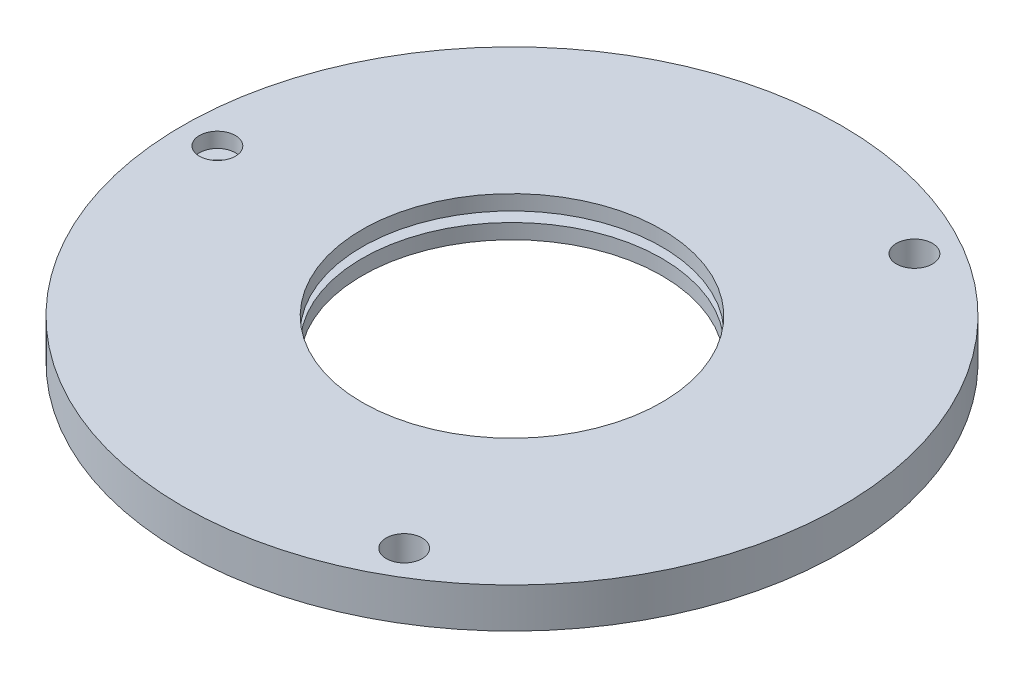
ISO-10303-21;
HEADER;
FILE_DESCRIPTION(('STEP AP214'),'2;1');
FILE_NAME('part.step','',(''),(''),'','','');
FILE_SCHEMA(('AUTOMOTIVE_DESIGN { 1 0 10303 214 1 1 1 1 }'));
ENDSEC;
DATA;
#1=APPLICATION_CONTEXT('core data for automotive mechanical design processes');
#2=APPLICATION_PROTOCOL_DEFINITION('international standard','automotive_design',2000,#1);
#3=PRODUCT_CONTEXT('',#1,'mechanical');
#4=PRODUCT('Part','Part','',(#3));
#5=PRODUCT_RELATED_PRODUCT_CATEGORY('part','',(#4));
#6=PRODUCT_DEFINITION_FORMATION('','',#4);
#7=PRODUCT_DEFINITION_CONTEXT('part definition',#1,'design');
#8=PRODUCT_DEFINITION('design','',#6,#7);
#9=PRODUCT_DEFINITION_SHAPE('','',#8);
#10=(LENGTH_UNIT() NAMED_UNIT(*) SI_UNIT(.MILLI.,.METRE.));
#11=(NAMED_UNIT(*) PLANE_ANGLE_UNIT() SI_UNIT($,.RADIAN.));
#12=(NAMED_UNIT(*) SI_UNIT($,.STERADIAN.) SOLID_ANGLE_UNIT());
#13=UNCERTAINTY_MEASURE_WITH_UNIT(LENGTH_MEASURE(1.E-05),#10,'distance_accuracy_value','');
#14=(GEOMETRIC_REPRESENTATION_CONTEXT(3) GLOBAL_UNCERTAINTY_ASSIGNED_CONTEXT((#13)) GLOBAL_UNIT_ASSIGNED_CONTEXT((#10,
#11,#12)) REPRESENTATION_CONTEXT('',''));
#15=CARTESIAN_POINT('',(0.,0.,0.));
#16=DIRECTION('',(0.,0.,1.));
#17=DIRECTION('',(1.,0.,0.));
#18=AXIS2_PLACEMENT_3D('',#15,#16,#17);
#19=CARTESIAN_POINT('',(-29.5,0.,0.));
#20=DIRECTION('',(0.,-1.,0.));
#21=DIRECTION('',(0.,0.,-1.));
#22=AXIS2_PLACEMENT_3D('',#19,#20,#21);
#23=CYLINDRICAL_SURFACE('',#22,1.8);
#24=CARTESIAN_POINT('',(-29.5,1.5,0.));
#25=DIRECTION('',(0.,-1.,0.));
#26=DIRECTION('',(0.,0.,-1.));
#27=AXIS2_PLACEMENT_3D('',#24,#25,#26);
#28=CIRCLE('',#27,1.8);
#29=CARTESIAN_POINT('',(-29.5,1.5,-1.8));
#30=VERTEX_POINT('',#29);
#31=EDGE_CURVE('E109',#30,#30,#28,.F.);
#32=ORIENTED_EDGE('',*,*,#31,.T.);
#33=EDGE_LOOP('',(#32));
#34=FACE_BOUND('',#33,.T.);
#35=CARTESIAN_POINT('',(-29.5,1.35,0.));
#36=DIRECTION('',(0.,-1.,0.));
#37=DIRECTION('',(0.,0.,-1.));
#38=AXIS2_PLACEMENT_3D('',#35,#36,#37);
#39=CIRCLE('',#38,1.8);
#40=CARTESIAN_POINT('',(-29.5,1.35,-1.8));
#41=VERTEX_POINT('',#40);
#42=EDGE_CURVE('E131',#41,#41,#39,.T.);
#43=ORIENTED_EDGE('',*,*,#42,.T.);
#44=EDGE_LOOP('',(#43));
#45=FACE_BOUND('',#44,.T.);
#46=ADVANCED_FACE('F32',(#34,#45),#23,.F.);
#47=CARTESIAN_POINT('',(0.,4.001,0.));
#48=DIRECTION('',(0.,-1.,0.));
#49=DIRECTION('',(0.,0.,-1.));
#50=AXIS2_PLACEMENT_3D('',#47,#48,#49);
#51=CYLINDRICAL_SURFACE('',#50,15.);
#52=CARTESIAN_POINT('',(0.,1.5,0.));
#53=DIRECTION('',(0.,-1.,0.));
#54=DIRECTION('',(0.,0.,-1.));
#55=AXIS2_PLACEMENT_3D('',#52,#53,#54);
#56=CIRCLE('',#55,15.);
#57=CARTESIAN_POINT('',(0.,1.5,-15.));
#58=VERTEX_POINT('',#57);
#59=EDGE_CURVE('E108',#58,#58,#56,.F.);
#60=ORIENTED_EDGE('',*,*,#59,.T.);
#61=EDGE_LOOP('',(#60));
#62=FACE_BOUND('',#61,.T.);
#63=CARTESIAN_POINT('',(0.,0.,0.));
#64=DIRECTION('',(0.,-1.,0.));
#65=DIRECTION('',(0.,0.,-1.));
#66=AXIS2_PLACEMENT_3D('',#63,#64,#65);
#67=CIRCLE('',#66,15.);
#68=CARTESIAN_POINT('',(0.,0.,-15.));
#69=VERTEX_POINT('',#68);
#70=EDGE_CURVE('E114',#69,#69,#67,.T.);
#71=ORIENTED_EDGE('',*,*,#70,.T.);
#72=EDGE_LOOP('',(#71));
#73=FACE_BOUND('',#72,.T.);
#74=ADVANCED_FACE('F174',(#62,#73),#51,.F.);
#75=CARTESIAN_POINT('',(0.,0.,0.));
#76=DIRECTION('',(0.,1.,0.));
#77=DIRECTION('',(0.,0.,1.));
#78=AXIS2_PLACEMENT_3D('',#75,#76,#77);
#79=PLANE('',#78);
#80=ORIENTED_EDGE('',*,*,#70,.F.);
#81=EDGE_LOOP('',(#80));
#82=FACE_BOUND('',#81,.T.);
#83=CARTESIAN_POINT('',(14.7499999999996,0.,-25.5477494116416));
#84=DIRECTION('',(0.,-1.,0.));
#85=DIRECTION('',(0.,0.,-1.));
#86=AXIS2_PLACEMENT_3D('',#83,#84,#85);
#87=CIRCLE('',#86,3.15);
#88=CARTESIAN_POINT('',(14.7499999999996,0.,-28.6977494116416));
#89=VERTEX_POINT('',#88);
#90=EDGE_CURVE('E137',#89,#89,#87,.T.);
#91=ORIENTED_EDGE('',*,*,#90,.F.);
#92=EDGE_LOOP('',(#91));
#93=FACE_BOUND('',#92,.T.);
#94=CARTESIAN_POINT('',(0.,0.,0.));
#95=DIRECTION('',(0.,1.,0.));
#96=DIRECTION('',(0.,0.,1.));
#97=AXIS2_PLACEMENT_3D('',#94,#95,#96);
#98=CIRCLE('',#97,33.);
#99=CARTESIAN_POINT('',(0.,0.,33.));
#100=VERTEX_POINT('',#99);
#101=EDGE_CURVE('E146',#100,#100,#98,.T.);
#102=ORIENTED_EDGE('',*,*,#101,.F.);
#103=EDGE_LOOP('',(#102));
#104=FACE_BOUND('',#103,.T.);
#105=CARTESIAN_POINT('',(-29.5,0.,0.));
#106=DIRECTION('',(0.,-1.,0.));
#107=DIRECTION('',(0.,0.,-1.));
#108=AXIS2_PLACEMENT_3D('',#105,#106,#107);
#109=CIRCLE('',#108,3.15);
#110=CARTESIAN_POINT('',(-29.5,0.,-3.15));
#111=VERTEX_POINT('',#110);
#112=EDGE_CURVE('E128',#111,#111,#109,.T.);
#113=ORIENTED_EDGE('',*,*,#112,.F.);
#114=EDGE_LOOP('',(#113));
#115=FACE_BOUND('',#114,.T.);
#116=CARTESIAN_POINT('',(14.7500000000004,0.,25.5477494116403));
#117=DIRECTION('',(0.,-1.,0.));
#118=DIRECTION('',(0.,0.,-1.));
#119=AXIS2_PLACEMENT_3D('',#116,#117,#118);
#120=CIRCLE('',#119,3.15);
#121=CARTESIAN_POINT('',(14.7500000000004,0.,22.3977494116403));
#122=VERTEX_POINT('',#121);
#123=EDGE_CURVE('E117',#122,#122,#120,.T.);
#124=ORIENTED_EDGE('',*,*,#123,.F.);
#125=EDGE_LOOP('',(#124));
#126=FACE_BOUND('',#125,.T.);
#127=ADVANCED_FACE('F181',(#82,#93,#104,#115,#126),#79,.F.);
#128=CARTESIAN_POINT('',(0.,4.,0.));
#129=DIRECTION('',(0.,1.,0.));
#130=DIRECTION('',(0.,0.,1.));
#131=AXIS2_PLACEMENT_3D('',#128,#129,#130);
#132=PLANE('',#131);
#133=CARTESIAN_POINT('',(0.,4.,0.));
#134=DIRECTION('',(0.,1.,0.));
#135=DIRECTION('',(0.,0.,1.));
#136=AXIS2_PLACEMENT_3D('',#133,#134,#135);
#137=CIRCLE('',#136,15.);
#138=CARTESIAN_POINT('',(0.,4.,15.));
#139=VERTEX_POINT('',#138);
#140=EDGE_CURVE('E113',#139,#139,#137,.F.);
#141=ORIENTED_EDGE('',*,*,#140,.T.);
#142=EDGE_LOOP('',(#141));
#143=FACE_BOUND('',#142,.T.);
#144=CARTESIAN_POINT('',(14.7499999999996,4.,-25.5477494116416));
#145=DIRECTION('',(0.,-1.,0.));
#146=DIRECTION('',(0.,0.,-1.));
#147=AXIS2_PLACEMENT_3D('',#144,#145,#146);
#148=CIRCLE('',#147,1.8);
#149=CARTESIAN_POINT('',(14.7499999999996,4.,-27.3477494116416));
#150=VERTEX_POINT('',#149);
#151=EDGE_CURVE('E143',#150,#150,#148,.T.);
#152=ORIENTED_EDGE('',*,*,#151,.T.);
#153=EDGE_LOOP('',(#152));
#154=FACE_BOUND('',#153,.T.);
#155=CARTESIAN_POINT('',(0.,4.,0.));
#156=DIRECTION('',(0.,1.,0.));
#157=DIRECTION('',(0.,0.,1.));
#158=AXIS2_PLACEMENT_3D('',#155,#156,#157);
#159=CIRCLE('',#158,33.);
#160=CARTESIAN_POINT('',(0.,4.,33.));
#161=VERTEX_POINT('',#160);
#162=EDGE_CURVE('E147',#161,#161,#159,.T.);
#163=ORIENTED_EDGE('',*,*,#162,.T.);
#164=EDGE_LOOP('',(#163));
#165=FACE_BOUND('',#164,.T.);
#166=CARTESIAN_POINT('',(-29.5,4.,0.));
#167=DIRECTION('',(0.,-1.,0.));
#168=DIRECTION('',(0.,0.,-1.));
#169=AXIS2_PLACEMENT_3D('',#166,#167,#168);
#170=CIRCLE('',#169,1.8);
#171=CARTESIAN_POINT('',(-29.5,4.,-1.8));
#172=VERTEX_POINT('',#171);
#173=EDGE_CURVE('E134',#172,#172,#170,.T.);
#174=ORIENTED_EDGE('',*,*,#173,.T.);
#175=EDGE_LOOP('',(#174));
#176=FACE_BOUND('',#175,.T.);
#177=CARTESIAN_POINT('',(14.7500000000004,4.,25.5477494116403));
#178=DIRECTION('',(0.,-1.,0.));
#179=DIRECTION('',(0.,0.,-1.));
#180=AXIS2_PLACEMENT_3D('',#177,#178,#179);
#181=CIRCLE('',#180,1.8);
#182=CARTESIAN_POINT('',(14.7500000000004,4.,23.7477494116403));
#183=VERTEX_POINT('',#182);
#184=EDGE_CURVE('E125',#183,#183,#181,.T.);
#185=ORIENTED_EDGE('',*,*,#184,.T.);
#186=EDGE_LOOP('',(#185));
#187=FACE_BOUND('',#186,.T.);
#188=ADVANCED_FACE('F204',(#143,#154,#165,#176,#187),#132,.T.);
#189=CARTESIAN_POINT('',(0.,4.,0.));
#190=DIRECTION('',(0.,-1.,0.));
#191=DIRECTION('',(0.,0.,-1.));
#192=AXIS2_PLACEMENT_3D('',#189,#190,#191);
#193=CYLINDRICAL_SURFACE('',#192,33.);
#194=DIRECTION('',(0.,-1.,0.));
#195=VECTOR('',#194,1.);
#196=CARTESIAN_POINT('',(-26.2488094968134,4.,-20.));
#197=LINE('',#196,#195);
#198=CARTESIAN_POINT('',(-26.2488094968134,1.5,-20.));
#199=VERTEX_POINT('',#198);
#200=CARTESIAN_POINT('',(-26.2488094968134,2.5,-20.));
#201=VERTEX_POINT('',#200);
#202=EDGE_CURVE('E11',#199,#201,#197,.F.);
#203=ORIENTED_EDGE('',*,*,#202,.T.);
#204=CARTESIAN_POINT('',(0.,2.5,0.));
#205=DIRECTION('',(0.,1.,0.));
#206=DIRECTION('',(0.,0.,1.));
#207=AXIS2_PLACEMENT_3D('',#204,#205,#206);
#208=CIRCLE('',#207,33.);
#209=CARTESIAN_POINT('',(-26.2488094968134,2.5,20.));
#210=VERTEX_POINT('',#209);
#211=EDGE_CURVE('E46',#201,#210,#208,.T.);
#212=ORIENTED_EDGE('',*,*,#211,.T.);
#213=DIRECTION('',(0.,-1.,0.));
#214=VECTOR('',#213,1.);
#215=CARTESIAN_POINT('',(-26.2488094968134,4.,20.));
#216=LINE('',#215,#214);
#217=CARTESIAN_POINT('',(-26.2488094968134,1.5,20.));
#218=VERTEX_POINT('',#217);
#219=EDGE_CURVE('E40',#210,#218,#216,.T.);
#220=ORIENTED_EDGE('',*,*,#219,.T.);
#221=CARTESIAN_POINT('',(0.,1.5,0.));
#222=DIRECTION('',(0.,-1.,0.));
#223=DIRECTION('',(0.,0.,-1.));
#224=AXIS2_PLACEMENT_3D('',#221,#222,#223);
#225=CIRCLE('',#224,33.);
#226=EDGE_CURVE('E54',#218,#199,#225,.T.);
#227=ORIENTED_EDGE('',*,*,#226,.T.);
#228=EDGE_LOOP('',(#203,#212,#220,#227));
#229=FACE_BOUND('',#228,.T.);
#230=ORIENTED_EDGE('',*,*,#162,.F.);
#231=EDGE_LOOP('',(#230));
#232=FACE_BOUND('',#231,.T.);
#233=ORIENTED_EDGE('',*,*,#101,.T.);
#234=EDGE_LOOP('',(#233));
#235=FACE_BOUND('',#234,.T.);
#236=ADVANCED_FACE('F34',(#229,#232,#235),#193,.T.);
#237=CARTESIAN_POINT('',(14.7499999999996,0.,-25.5477494116416));
#238=DIRECTION('',(0.,-1.,0.));
#239=DIRECTION('',(0.,0.,-1.));
#240=AXIS2_PLACEMENT_3D('',#237,#238,#239);
#241=CYLINDRICAL_SURFACE('',#240,1.8);
#242=ORIENTED_EDGE('',*,*,#151,.F.);
#243=EDGE_LOOP('',(#242));
#244=FACE_BOUND('',#243,.T.);
#245=CARTESIAN_POINT('',(14.7499999999996,1.35,-25.5477494116416));
#246=DIRECTION('',(0.,-1.,0.));
#247=DIRECTION('',(0.,0.,-1.));
#248=AXIS2_PLACEMENT_3D('',#245,#246,#247);
#249=CIRCLE('',#248,1.8);
#250=CARTESIAN_POINT('',(14.7499999999996,1.35,-27.3477494116416));
#251=VERTEX_POINT('',#250);
#252=EDGE_CURVE('E140',#251,#251,#249,.T.);
#253=ORIENTED_EDGE('',*,*,#252,.T.);
#254=EDGE_LOOP('',(#253));
#255=FACE_BOUND('',#254,.T.);
#256=ADVANCED_FACE('F198',(#244,#255),#241,.F.);
#257=CARTESIAN_POINT('',(14.7499999999996,0.,-25.5477494116416));
#258=DIRECTION('',(0.,-1.,0.));
#259=DIRECTION('',(0.,0.,-1.));
#260=AXIS2_PLACEMENT_3D('',#257,#258,#259);
#261=CONICAL_SURFACE('',#260,3.15,0.785398163397447);
#262=ORIENTED_EDGE('',*,*,#252,.F.);
#263=EDGE_LOOP('',(#262));
#264=FACE_BOUND('',#263,.T.);
#265=ORIENTED_EDGE('',*,*,#90,.T.);
#266=EDGE_LOOP('',(#265));
#267=FACE_BOUND('',#266,.T.);
#268=ADVANCED_FACE('F190',(#264,#267),#261,.F.);
#269=CARTESIAN_POINT('',(-29.5,2.5,0.));
#270=DIRECTION('',(0.,1.,0.));
#271=DIRECTION('',(0.,0.,1.));
#272=AXIS2_PLACEMENT_3D('',#269,#270,#271);
#273=CIRCLE('',#272,1.8);
#274=CARTESIAN_POINT('',(-29.5,2.5,1.8));
#275=VERTEX_POINT('',#274);
#276=EDGE_CURVE('E104',#275,#275,#273,.F.);
#277=ORIENTED_EDGE('',*,*,#276,.T.);
#278=EDGE_LOOP('',(#277));
#279=FACE_BOUND('',#278,.T.);
#280=ORIENTED_EDGE('',*,*,#173,.F.);
#281=EDGE_LOOP('',(#280));
#282=FACE_BOUND('',#281,.T.);
#283=ADVANCED_FACE('F177',(#279,#282),#23,.F.);
#284=CARTESIAN_POINT('',(-29.5,0.,0.));
#285=DIRECTION('',(0.,-1.,0.));
#286=DIRECTION('',(0.,0.,-1.));
#287=AXIS2_PLACEMENT_3D('',#284,#285,#286);
#288=CONICAL_SURFACE('',#287,3.15,0.785398163397449);
#289=ORIENTED_EDGE('',*,*,#42,.F.);
#290=EDGE_LOOP('',(#289));
#291=FACE_BOUND('',#290,.T.);
#292=ORIENTED_EDGE('',*,*,#112,.T.);
#293=EDGE_LOOP('',(#292));
#294=FACE_BOUND('',#293,.T.);
#295=ADVANCED_FACE('F189',(#291,#294),#288,.F.);
#296=CARTESIAN_POINT('',(14.7500000000004,0.,25.5477494116403));
#297=DIRECTION('',(0.,-1.,0.));
#298=DIRECTION('',(0.,0.,-1.));
#299=AXIS2_PLACEMENT_3D('',#296,#297,#298);
#300=CYLINDRICAL_SURFACE('',#299,1.8);
#301=ORIENTED_EDGE('',*,*,#184,.F.);
#302=EDGE_LOOP('',(#301));
#303=FACE_BOUND('',#302,.T.);
#304=CARTESIAN_POINT('',(14.7500000000004,1.35,25.5477494116403));
#305=DIRECTION('',(0.,-1.,0.));
#306=DIRECTION('',(0.,0.,-1.));
#307=AXIS2_PLACEMENT_3D('',#304,#305,#306);
#308=CIRCLE('',#307,1.8);
#309=CARTESIAN_POINT('',(14.7500000000004,1.35,23.7477494116403));
#310=VERTEX_POINT('',#309);
#311=EDGE_CURVE('E122',#310,#310,#308,.T.);
#312=ORIENTED_EDGE('',*,*,#311,.T.);
#313=EDGE_LOOP('',(#312));
#314=FACE_BOUND('',#313,.T.);
#315=ADVANCED_FACE('F196',(#303,#314),#300,.F.);
#316=CARTESIAN_POINT('',(14.7500000000004,0.,25.5477494116403));
#317=DIRECTION('',(0.,-1.,0.));
#318=DIRECTION('',(0.,0.,-1.));
#319=AXIS2_PLACEMENT_3D('',#316,#317,#318);
#320=CONICAL_SURFACE('',#319,3.15,0.785398163397449);
#321=ORIENTED_EDGE('',*,*,#311,.F.);
#322=EDGE_LOOP('',(#321));
#323=FACE_BOUND('',#322,.T.);
#324=ORIENTED_EDGE('',*,*,#123,.T.);
#325=EDGE_LOOP('',(#324));
#326=FACE_BOUND('',#325,.T.);
#327=ADVANCED_FACE('F213',(#323,#326),#320,.F.);
#328=CARTESIAN_POINT('',(0.,2.5,0.));
#329=DIRECTION('',(0.,1.,0.));
#330=DIRECTION('',(0.,0.,1.));
#331=AXIS2_PLACEMENT_3D('',#328,#329,#330);
#332=CIRCLE('',#331,15.);
#333=CARTESIAN_POINT('',(0.,2.5,15.));
#334=VERTEX_POINT('',#333);
#335=EDGE_CURVE('E100',#334,#334,#332,.F.);
#336=ORIENTED_EDGE('',*,*,#335,.T.);
#337=EDGE_LOOP('',(#336));
#338=FACE_BOUND('',#337,.T.);
#339=ORIENTED_EDGE('',*,*,#140,.F.);
#340=EDGE_LOOP('',(#339));
#341=FACE_BOUND('',#340,.T.);
#342=ADVANCED_FACE('F184',(#338,#341),#51,.F.);
#343=CARTESIAN_POINT('',(17.,2.5,20.));
#344=DIRECTION('',(0.,0.,1.));
#345=DIRECTION('',(1.,0.,0.));
#346=AXIS2_PLACEMENT_3D('',#343,#344,#345);
#347=PLANE('',#346);
#348=DIRECTION('',(-1.,0.,0.));
#349=VECTOR('',#348,1.);
#350=CARTESIAN_POINT('',(17.,2.5,20.));
#351=LINE('',#350,#349);
#352=CARTESIAN_POINT('',(17.,2.5,20.));
#353=VERTEX_POINT('',#352);
#354=EDGE_CURVE('E73',#353,#210,#351,.T.);
#355=ORIENTED_EDGE('',*,*,#354,.F.);
#356=DIRECTION('',(0.,1.,0.));
#357=VECTOR('',#356,1.);
#358=CARTESIAN_POINT('',(17.,2.5,20.));
#359=LINE('',#358,#357);
#360=CARTESIAN_POINT('',(17.,1.5,20.));
#361=VERTEX_POINT('',#360);
#362=EDGE_CURVE('E77',#361,#353,#359,.T.);
#363=ORIENTED_EDGE('',*,*,#362,.F.);
#364=DIRECTION('',(-1.,0.,0.));
#365=VECTOR('',#364,1.);
#366=CARTESIAN_POINT('',(17.,1.5,20.));
#367=LINE('',#366,#365);
#368=EDGE_CURVE('E98',#361,#218,#367,.T.);
#369=ORIENTED_EDGE('',*,*,#368,.T.);
#370=ORIENTED_EDGE('',*,*,#219,.F.);
#371=EDGE_LOOP('',(#355,#363,#369,#370));
#372=FACE_BOUND('',#371,.T.);
#373=ADVANCED_FACE('F75',(#372),#347,.F.);
#374=CARTESIAN_POINT('',(17.,2.5,-20.));
#375=DIRECTION('',(0.,0.,-1.));
#376=DIRECTION('',(-1.,0.,0.));
#377=AXIS2_PLACEMENT_3D('',#374,#375,#376);
#378=PLANE('',#377);
#379=DIRECTION('',(-1.,0.,0.));
#380=VECTOR('',#379,1.);
#381=CARTESIAN_POINT('',(17.,1.5,-20.));
#382=LINE('',#381,#380);
#383=CARTESIAN_POINT('',(17.,1.5,-20.));
#384=VERTEX_POINT('',#383);
#385=EDGE_CURVE('E101',#384,#199,#382,.T.);
#386=ORIENTED_EDGE('',*,*,#385,.F.);
#387=DIRECTION('',(0.,-1.,0.));
#388=VECTOR('',#387,1.);
#389=CARTESIAN_POINT('',(17.,2.5,-20.));
#390=LINE('',#389,#388);
#391=CARTESIAN_POINT('',(17.,2.5,-20.));
#392=VERTEX_POINT('',#391);
#393=EDGE_CURVE('E90',#392,#384,#390,.T.);
#394=ORIENTED_EDGE('',*,*,#393,.F.);
#395=DIRECTION('',(-1.,0.,0.));
#396=VECTOR('',#395,1.);
#397=CARTESIAN_POINT('',(17.,2.5,-20.));
#398=LINE('',#397,#396);
#399=EDGE_CURVE('E80',#392,#201,#398,.T.);
#400=ORIENTED_EDGE('',*,*,#399,.T.);
#401=ORIENTED_EDGE('',*,*,#202,.F.);
#402=EDGE_LOOP('',(#386,#394,#400,#401));
#403=FACE_BOUND('',#402,.T.);
#404=ADVANCED_FACE('F158',(#403),#378,.F.);
#405=CARTESIAN_POINT('',(17.,1.5,-20.));
#406=DIRECTION('',(0.,-1.,0.));
#407=DIRECTION('',(0.,0.,-1.));
#408=AXIS2_PLACEMENT_3D('',#405,#406,#407);
#409=PLANE('',#408);
#410=ORIENTED_EDGE('',*,*,#59,.F.);
#411=EDGE_LOOP('',(#410));
#412=FACE_BOUND('',#411,.T.);
#413=ORIENTED_EDGE('',*,*,#31,.F.);
#414=EDGE_LOOP('',(#413));
#415=FACE_BOUND('',#414,.T.);
#416=ORIENTED_EDGE('',*,*,#368,.F.);
#417=DIRECTION('',(0.,0.,1.));
#418=VECTOR('',#417,1.);
#419=CARTESIAN_POINT('',(17.,1.5,-20.));
#420=LINE('',#419,#418);
#421=EDGE_CURVE('E81',#384,#361,#420,.T.);
#422=ORIENTED_EDGE('',*,*,#421,.F.);
#423=ORIENTED_EDGE('',*,*,#385,.T.);
#424=ORIENTED_EDGE('',*,*,#226,.F.);
#425=EDGE_LOOP('',(#416,#422,#423,#424));
#426=FACE_BOUND('',#425,.T.);
#427=ADVANCED_FACE('F159',(#412,#415,#426),#409,.F.);
#428=CARTESIAN_POINT('',(17.,2.5,-20.));
#429=DIRECTION('',(0.,1.,0.));
#430=DIRECTION('',(0.,0.,1.));
#431=AXIS2_PLACEMENT_3D('',#428,#429,#430);
#432=PLANE('',#431);
#433=ORIENTED_EDGE('',*,*,#335,.F.);
#434=EDGE_LOOP('',(#433));
#435=FACE_BOUND('',#434,.T.);
#436=ORIENTED_EDGE('',*,*,#276,.F.);
#437=EDGE_LOOP('',(#436));
#438=FACE_BOUND('',#437,.T.);
#439=ORIENTED_EDGE('',*,*,#399,.F.);
#440=DIRECTION('',(0.,0.,-1.));
#441=VECTOR('',#440,1.);
#442=CARTESIAN_POINT('',(17.,2.5,-20.));
#443=LINE('',#442,#441);
#444=EDGE_CURVE('E84',#353,#392,#443,.T.);
#445=ORIENTED_EDGE('',*,*,#444,.F.);
#446=ORIENTED_EDGE('',*,*,#354,.T.);
#447=ORIENTED_EDGE('',*,*,#211,.F.);
#448=EDGE_LOOP('',(#439,#445,#446,#447));
#449=FACE_BOUND('',#448,.T.);
#450=ADVANCED_FACE('F85',(#435,#438,#449),#432,.F.);
#451=CARTESIAN_POINT('',(17.,0.,0.));
#452=DIRECTION('',(-1.,0.,0.));
#453=DIRECTION('',(0.,0.,1.));
#454=AXIS2_PLACEMENT_3D('',#451,#452,#453);
#455=PLANE('',#454);
#456=ORIENTED_EDGE('',*,*,#362,.T.);
#457=ORIENTED_EDGE('',*,*,#444,.T.);
#458=ORIENTED_EDGE('',*,*,#393,.T.);
#459=ORIENTED_EDGE('',*,*,#421,.T.);
#460=EDGE_LOOP('',(#456,#457,#458,#459));
#461=FACE_BOUND('',#460,.T.);
#462=ADVANCED_FACE('F92',(#461),#455,.T.);
#463=CLOSED_SHELL('',(#46,#74,#127,#188,#236,#256,#268,#283,#295,#315,#327,#342,#373,#404,#427,
#450,#462));
#464=MANIFOLD_SOLID_BREP('B2',#463);
#465=ADVANCED_BREP_SHAPE_REPRESENTATION('',(#18,#464),#14);
#466=SHAPE_DEFINITION_REPRESENTATION(#9,#465);
ENDSEC;
END-ISO-10303-21;
